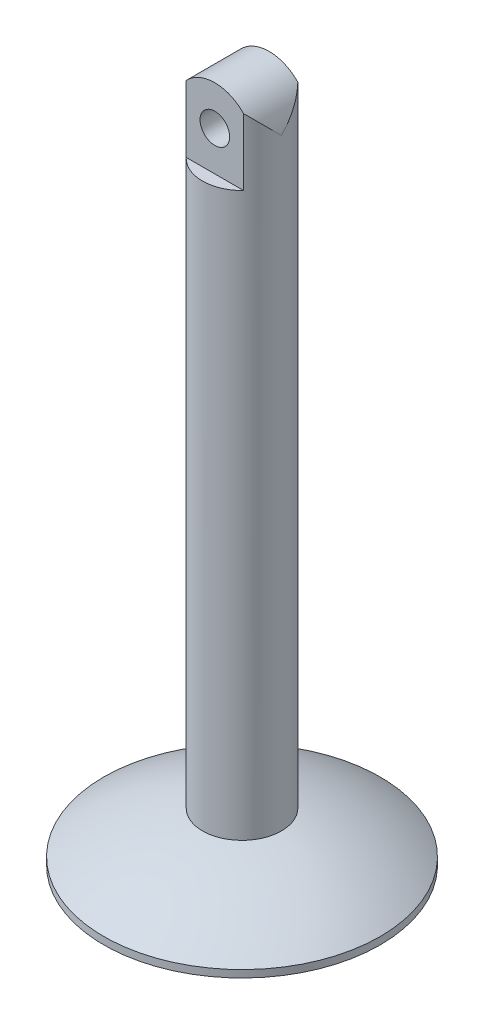
ISO-10303-21;
HEADER;
FILE_DESCRIPTION(('STEP AP214'),'2;1');
FILE_NAME('part.step','',(''),(''),'','','');
FILE_SCHEMA(('AUTOMOTIVE_DESIGN { 1 0 10303 214 1 1 1 1 }'));
ENDSEC;
DATA;
#1=APPLICATION_CONTEXT('core data for automotive mechanical design processes');
#2=APPLICATION_PROTOCOL_DEFINITION('international standard','automotive_design',2000,#1);
#3=PRODUCT_CONTEXT('',#1,'mechanical');
#4=PRODUCT('Part','Part','',(#3));
#5=PRODUCT_RELATED_PRODUCT_CATEGORY('part','',(#4));
#6=PRODUCT_DEFINITION_FORMATION('','',#4);
#7=PRODUCT_DEFINITION_CONTEXT('part definition',#1,'design');
#8=PRODUCT_DEFINITION('design','',#6,#7);
#9=PRODUCT_DEFINITION_SHAPE('','',#8);
#10=(LENGTH_UNIT() NAMED_UNIT(*) SI_UNIT(.MILLI.,.METRE.));
#11=(NAMED_UNIT(*) PLANE_ANGLE_UNIT() SI_UNIT($,.RADIAN.));
#12=(NAMED_UNIT(*) SI_UNIT($,.STERADIAN.) SOLID_ANGLE_UNIT());
#13=UNCERTAINTY_MEASURE_WITH_UNIT(LENGTH_MEASURE(1.E-05),#10,'distance_accuracy_value','');
#14=(GEOMETRIC_REPRESENTATION_CONTEXT(3) GLOBAL_UNCERTAINTY_ASSIGNED_CONTEXT((#13)) GLOBAL_UNIT_ASSIGNED_CONTEXT((#10,
#11,#12)) REPRESENTATION_CONTEXT('',''));
#15=CARTESIAN_POINT('',(0.,0.,0.));
#16=DIRECTION('',(0.,0.,1.));
#17=DIRECTION('',(1.,0.,0.));
#18=AXIS2_PLACEMENT_3D('',#15,#16,#17);
#19=CARTESIAN_POINT('',(0.,0.,0.));
#20=DIRECTION('',(0.,1.,0.));
#21=DIRECTION('',(-1.,0.,0.));
#22=AXIS2_PLACEMENT_3D('',#19,#20,#21);
#23=CYLINDRICAL_SURFACE('',#22,4.);
#24=CARTESIAN_POINT('',(0.,-8.,0.));
#25=DIRECTION('',(0.,-1.,0.));
#26=DIRECTION('',(0.,0.,-1.));
#27=AXIS2_PLACEMENT_3D('',#24,#25,#26);
#28=CIRCLE('',#27,4.);
#29=CARTESIAN_POINT('',(2.90473750965557,-8.,-2.75));
#30=VERTEX_POINT('',#29);
#31=CARTESIAN_POINT('',(-2.90473750965556,-8.,-2.75));
#32=VERTEX_POINT('',#31);
#33=EDGE_CURVE('E12',#30,#32,#28,.F.);
#34=ORIENTED_EDGE('',*,*,#33,.F.);
#35=DIRECTION('',(0.,1.,0.));
#36=VECTOR('',#35,1.);
#37=CARTESIAN_POINT('',(2.90473750965556,0.,-2.75));
#38=LINE('',#37,#36);
#39=CARTESIAN_POINT('',(2.90473750965556,-1.25,-2.75));
#40=VERTEX_POINT('',#39);
#41=EDGE_CURVE('E177',#40,#30,#38,.F.);
#42=ORIENTED_EDGE('',*,*,#41,.F.);
#43=CARTESIAN_POINT('',(0.,-4.,0.));
#44=DIRECTION('',(0.,0.707106781186547,0.707106781186547));
#45=DIRECTION('',(0.,0.707106781186547,-0.707106781186547));
#46=AXIS2_PLACEMENT_3D('',#43,#44,#45);
#47=ELLIPSE('',#46,5.65685424949238,4.);
#48=CARTESIAN_POINT('',(4.,-4.,0.));
#49=VERTEX_POINT('',#48);
#50=EDGE_CURVE('E207',#40,#49,#47,.F.);
#51=ORIENTED_EDGE('',*,*,#50,.T.);
#52=CARTESIAN_POINT('',(0.,-4.,0.));
#53=DIRECTION('',(0.,0.707106781186547,-0.707106781186547));
#54=DIRECTION('',(0.,0.707106781186547,0.707106781186547));
#55=AXIS2_PLACEMENT_3D('',#52,#53,#54);
#56=ELLIPSE('',#55,5.65685424949238,4.);
#57=CARTESIAN_POINT('',(2.90473750965556,-1.25,2.75));
#58=VERTEX_POINT('',#57);
#59=EDGE_CURVE('E204',#49,#58,#56,.F.);
#60=ORIENTED_EDGE('',*,*,#59,.T.);
#61=DIRECTION('',(0.,1.,0.));
#62=VECTOR('',#61,1.);
#63=CARTESIAN_POINT('',(2.90473750965556,0.,2.75));
#64=LINE('',#63,#62);
#65=CARTESIAN_POINT('',(2.90473750965556,-8.,2.75));
#66=VERTEX_POINT('',#65);
#67=EDGE_CURVE('E133',#58,#66,#64,.F.);
#68=ORIENTED_EDGE('',*,*,#67,.T.);
#69=CARTESIAN_POINT('',(0.,-8.,0.));
#70=DIRECTION('',(0.,-1.,0.));
#71=DIRECTION('',(0.,0.,-1.));
#72=AXIS2_PLACEMENT_3D('',#69,#70,#71);
#73=CIRCLE('',#72,4.);
#74=CARTESIAN_POINT('',(-2.90473750965556,-8.,2.75));
#75=VERTEX_POINT('',#74);
#76=EDGE_CURVE('E126',#75,#66,#73,.F.);
#77=ORIENTED_EDGE('',*,*,#76,.F.);
#78=DIRECTION('',(0.,1.,0.));
#79=VECTOR('',#78,1.);
#80=CARTESIAN_POINT('',(-2.90473750965556,0.,2.75));
#81=LINE('',#80,#79);
#82=CARTESIAN_POINT('',(-2.90473750965556,-1.25,2.75));
#83=VERTEX_POINT('',#82);
#84=EDGE_CURVE('E192',#75,#83,#81,.T.);
#85=ORIENTED_EDGE('',*,*,#84,.T.);
#86=CARTESIAN_POINT('',(-4.,-4.,0.));
#87=VERTEX_POINT('',#86);
#88=EDGE_CURVE('E141',#83,#87,#56,.F.);
#89=ORIENTED_EDGE('',*,*,#88,.T.);
#90=CARTESIAN_POINT('',(-2.90473750965556,-1.25,-2.75));
#91=VERTEX_POINT('',#90);
#92=EDGE_CURVE('E181',#87,#91,#47,.F.);
#93=ORIENTED_EDGE('',*,*,#92,.T.);
#94=DIRECTION('',(0.,1.,0.));
#95=VECTOR('',#94,1.);
#96=CARTESIAN_POINT('',(-2.90473750965556,0.,-2.75));
#97=LINE('',#96,#95);
#98=EDGE_CURVE('E176',#32,#91,#97,.T.);
#99=ORIENTED_EDGE('',*,*,#98,.F.);
#100=EDGE_LOOP('',(#34,#42,#51,#60,#68,#77,#85,#89,#93,#99));
#101=FACE_BOUND('',#100,.T.);
#102=CARTESIAN_POINT('',(0.,-65.,0.));
#103=DIRECTION('',(0.,1.,0.));
#104=DIRECTION('',(-1.,0.,0.));
#105=AXIS2_PLACEMENT_3D('',#102,#103,#104);
#106=CIRCLE('',#105,4.);
#107=CARTESIAN_POINT('',(-3.99999999999999,-65.,0.));
#108=VERTEX_POINT('',#107);
#109=EDGE_CURVE('E195',#108,#108,#106,.T.);
#110=ORIENTED_EDGE('',*,*,#109,.T.);
#111=EDGE_LOOP('',(#110));
#112=FACE_BOUND('',#111,.T.);
#113=ADVANCED_FACE('F118',(#101,#112),#23,.T.);
#114=CARTESIAN_POINT('',(0.,-4.,-14.));
#115=DIRECTION('',(0.,0.,1.));
#116=DIRECTION('',(1.,0.,0.));
#117=AXIS2_PLACEMENT_3D('',#114,#115,#116);
#118=CYLINDRICAL_SURFACE('',#117,4.);
#119=CARTESIAN_POINT('',(0.,-4.,-2.75));
#120=DIRECTION('',(0.,0.,1.));
#121=DIRECTION('',(0.,-1.,0.));
#122=AXIS2_PLACEMENT_3D('',#119,#120,#121);
#123=CIRCLE('',#122,4.);
#124=EDGE_CURVE('E182',#91,#40,#123,.F.);
#125=ORIENTED_EDGE('',*,*,#124,.F.);
#126=ORIENTED_EDGE('',*,*,#92,.F.);
#127=ORIENTED_EDGE('',*,*,#88,.F.);
#128=CARTESIAN_POINT('',(0.,-4.,2.75));
#129=DIRECTION('',(0.,0.,1.));
#130=DIRECTION('',(0.,-1.,0.));
#131=AXIS2_PLACEMENT_3D('',#128,#129,#130);
#132=CIRCLE('',#131,4.);
#133=EDGE_CURVE('E190',#83,#58,#132,.F.);
#134=ORIENTED_EDGE('',*,*,#133,.T.);
#135=ORIENTED_EDGE('',*,*,#59,.F.);
#136=ORIENTED_EDGE('',*,*,#50,.F.);
#137=EDGE_LOOP('',(#125,#126,#127,#134,#135,#136));
#138=FACE_BOUND('',#137,.T.);
#139=ADVANCED_FACE('F229',(#138),#118,.T.);
#140=CARTESIAN_POINT('',(0.,-4.,-14.));
#141=DIRECTION('',(0.,0.,1.));
#142=DIRECTION('',(1.,0.,0.));
#143=AXIS2_PLACEMENT_3D('',#140,#141,#142);
#144=CYLINDRICAL_SURFACE('',#143,1.5);
#145=CARTESIAN_POINT('',(0.,-4.,-2.75));
#146=DIRECTION('',(0.,0.,1.));
#147=DIRECTION('',(0.,-1.,0.));
#148=AXIS2_PLACEMENT_3D('',#145,#146,#147);
#149=CIRCLE('',#148,1.5);
#150=CARTESIAN_POINT('',(0.,-5.5,-2.75));
#151=VERTEX_POINT('',#150);
#152=EDGE_CURVE('E178',#151,#151,#149,.F.);
#153=ORIENTED_EDGE('',*,*,#152,.T.);
#154=EDGE_LOOP('',(#153));
#155=FACE_BOUND('',#154,.T.);
#156=CARTESIAN_POINT('',(0.,-4.,2.75));
#157=DIRECTION('',(0.,0.,1.));
#158=DIRECTION('',(0.,-1.,0.));
#159=AXIS2_PLACEMENT_3D('',#156,#157,#158);
#160=CIRCLE('',#159,1.5);
#161=CARTESIAN_POINT('',(0.,-5.5,2.75));
#162=VERTEX_POINT('',#161);
#163=EDGE_CURVE('E189',#162,#162,#160,.F.);
#164=ORIENTED_EDGE('',*,*,#163,.F.);
#165=EDGE_LOOP('',(#164));
#166=FACE_BOUND('',#165,.T.);
#167=ADVANCED_FACE('F214',(#155,#166),#144,.F.);
#168=CARTESIAN_POINT('',(0.,-90.5216544875138,0.));
#169=DIRECTION('',(0.,1.,0.));
#170=DIRECTION('',(-1.,0.,0.));
#171=AXIS2_PLACEMENT_3D('',#168,#169,#170);
#172=DEGENERATE_TOROIDAL_SURFACE('',#171,0.964388403415363,26.,.F.);
#173=ORIENTED_EDGE('',*,*,#109,.F.);
#174=EDGE_LOOP('',(#173));
#175=FACE_BOUND('',#174,.T.);
#176=CARTESIAN_POINT('',(0.,-69.2597853384543,0.));
#177=DIRECTION('',(0.,1.,0.));
#178=DIRECTION('',(-1.,0.,0.));
#179=AXIS2_PLACEMENT_3D('',#176,#177,#178);
#180=CIRCLE('',#179,14.);
#181=CARTESIAN_POINT('',(-14.,-69.2597853384543,0.));
#182=VERTEX_POINT('',#181);
#183=EDGE_CURVE('E201',#182,#182,#180,.T.);
#184=ORIENTED_EDGE('',*,*,#183,.T.);
#185=EDGE_LOOP('',(#184));
#186=FACE_BOUND('',#185,.T.);
#187=ADVANCED_FACE('F120',(#175,#186),#172,.F.);
#188=CARTESIAN_POINT('',(0.,0.,0.));
#189=DIRECTION('',(0.,1.,0.));
#190=DIRECTION('',(-1.,0.,0.));
#191=AXIS2_PLACEMENT_3D('',#188,#189,#190);
#192=CYLINDRICAL_SURFACE('',#191,14.);
#193=CARTESIAN_POINT('',(0.,-70.,0.));
#194=DIRECTION('',(0.,1.,0.));
#195=DIRECTION('',(-1.,0.,0.));
#196=AXIS2_PLACEMENT_3D('',#193,#194,#195);
#197=CIRCLE('',#196,14.);
#198=CARTESIAN_POINT('',(-14.,-70.,0.));
#199=VERTEX_POINT('',#198);
#200=EDGE_CURVE('E198',#199,#199,#197,.T.);
#201=ORIENTED_EDGE('',*,*,#200,.T.);
#202=EDGE_LOOP('',(#201));
#203=FACE_BOUND('',#202,.T.);
#204=ORIENTED_EDGE('',*,*,#183,.F.);
#205=EDGE_LOOP('',(#204));
#206=FACE_BOUND('',#205,.T.);
#207=ADVANCED_FACE('F240',(#203,#206),#192,.T.);
#208=CARTESIAN_POINT('',(0.,-70.,0.));
#209=DIRECTION('',(0.,1.,0.));
#210=DIRECTION('',(-1.,0.,0.));
#211=AXIS2_PLACEMENT_3D('',#208,#209,#210);
#212=PLANE('',#211);
#213=ORIENTED_EDGE('',*,*,#200,.F.);
#214=EDGE_LOOP('',(#213));
#215=FACE_BOUND('',#214,.T.);
#216=ADVANCED_FACE('F238',(#215),#212,.F.);
#217=CARTESIAN_POINT('',(-14.,0.,2.75));
#218=DIRECTION('',(0.,0.,1.));
#219=DIRECTION('',(0.,-1.,0.));
#220=AXIS2_PLACEMENT_3D('',#217,#218,#219);
#221=PLANE('',#220);
#222=ORIENTED_EDGE('',*,*,#133,.F.);
#223=ORIENTED_EDGE('',*,*,#84,.F.);
#224=DIRECTION('',(1.,0.,0.));
#225=VECTOR('',#224,1.);
#226=CARTESIAN_POINT('',(-14.,-8.,2.75));
#227=LINE('',#226,#225);
#228=EDGE_CURVE('E184',#75,#66,#227,.T.);
#229=ORIENTED_EDGE('',*,*,#228,.T.);
#230=ORIENTED_EDGE('',*,*,#67,.F.);
#231=EDGE_LOOP('',(#222,#223,#229,#230));
#232=FACE_BOUND('',#231,.T.);
#233=ORIENTED_EDGE('',*,*,#163,.T.);
#234=EDGE_LOOP('',(#233));
#235=FACE_BOUND('',#234,.T.);
#236=ADVANCED_FACE('F224',(#232,#235),#221,.T.);
#237=CARTESIAN_POINT('',(-14.,-8.,0.));
#238=DIRECTION('',(0.,-1.,0.));
#239=DIRECTION('',(0.,0.,-1.));
#240=AXIS2_PLACEMENT_3D('',#237,#238,#239);
#241=PLANE('',#240);
#242=ORIENTED_EDGE('',*,*,#228,.F.);
#243=ORIENTED_EDGE('',*,*,#76,.T.);
#244=EDGE_LOOP('',(#242,#243));
#245=FACE_BOUND('',#244,.T.);
#246=ADVANCED_FACE('F217',(#245),#241,.F.);
#247=CARTESIAN_POINT('',(-14.,0.,-2.75));
#248=DIRECTION('',(0.,0.,1.));
#249=DIRECTION('',(0.,-1.,0.));
#250=AXIS2_PLACEMENT_3D('',#247,#248,#249);
#251=PLANE('',#250);
#252=ORIENTED_EDGE('',*,*,#41,.T.);
#253=DIRECTION('',(1.,0.,0.));
#254=VECTOR('',#253,1.);
#255=CARTESIAN_POINT('',(-14.,-8.,-2.75));
#256=LINE('',#255,#254);
#257=EDGE_CURVE('E168',#32,#30,#256,.T.);
#258=ORIENTED_EDGE('',*,*,#257,.F.);
#259=ORIENTED_EDGE('',*,*,#98,.T.);
#260=ORIENTED_EDGE('',*,*,#124,.T.);
#261=EDGE_LOOP('',(#252,#258,#259,#260));
#262=FACE_BOUND('',#261,.T.);
#263=ORIENTED_EDGE('',*,*,#152,.F.);
#264=EDGE_LOOP('',(#263));
#265=FACE_BOUND('',#264,.T.);
#266=ADVANCED_FACE('F174',(#262,#265),#251,.F.);
#267=CARTESIAN_POINT('',(-14.,-8.,0.));
#268=DIRECTION('',(0.,-1.,0.));
#269=DIRECTION('',(0.,0.,-1.));
#270=AXIS2_PLACEMENT_3D('',#267,#268,#269);
#271=PLANE('',#270);
#272=ORIENTED_EDGE('',*,*,#33,.T.);
#273=ORIENTED_EDGE('',*,*,#257,.T.);
#274=EDGE_LOOP('',(#272,#273));
#275=FACE_BOUND('',#274,.T.);
#276=ADVANCED_FACE('F167',(#275),#271,.F.);
#277=CLOSED_SHELL('',(#113,#139,#167,#187,#207,#216,#236,#246,#266,#276));
#278=MANIFOLD_SOLID_BREP('B2',#277);
#279=ADVANCED_BREP_SHAPE_REPRESENTATION('',(#18,#278),#14);
#280=SHAPE_DEFINITION_REPRESENTATION(#9,#279);
ENDSEC;
END-ISO-10303-21;
